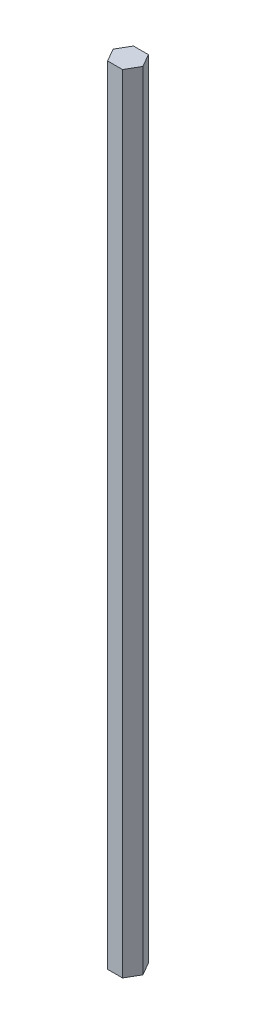
ISO-10303-21;
HEADER;
FILE_DESCRIPTION(('STEP AP214'),'2;1');
FILE_NAME('part.step','',(''),(''),'','','');
FILE_SCHEMA(('AUTOMOTIVE_DESIGN { 1 0 10303 214 1 1 1 1 }'));
ENDSEC;
DATA;
#1=APPLICATION_CONTEXT('core data for automotive mechanical design processes');
#2=APPLICATION_PROTOCOL_DEFINITION('international standard','automotive_design',2000,#1);
#3=PRODUCT_CONTEXT('',#1,'mechanical');
#4=PRODUCT('Part','Part','',(#3));
#5=PRODUCT_RELATED_PRODUCT_CATEGORY('part','',(#4));
#6=PRODUCT_DEFINITION_FORMATION('','',#4);
#7=PRODUCT_DEFINITION_CONTEXT('part definition',#1,'design');
#8=PRODUCT_DEFINITION('design','',#6,#7);
#9=PRODUCT_DEFINITION_SHAPE('','',#8);
#10=(LENGTH_UNIT() NAMED_UNIT(*) SI_UNIT(.MILLI.,.METRE.));
#11=(NAMED_UNIT(*) PLANE_ANGLE_UNIT() SI_UNIT($,.RADIAN.));
#12=(NAMED_UNIT(*) SI_UNIT($,.STERADIAN.) SOLID_ANGLE_UNIT());
#13=UNCERTAINTY_MEASURE_WITH_UNIT(LENGTH_MEASURE(1.E-05),#10,'distance_accuracy_value','');
#14=(GEOMETRIC_REPRESENTATION_CONTEXT(3) GLOBAL_UNCERTAINTY_ASSIGNED_CONTEXT((#13)) GLOBAL_UNIT_ASSIGNED_CONTEXT((#10,
#11,#12)) REPRESENTATION_CONTEXT('',''));
#15=CARTESIAN_POINT('',(0.,0.,0.));
#16=DIRECTION('',(0.,0.,1.));
#17=DIRECTION('',(1.,0.,0.));
#18=AXIS2_PLACEMENT_3D('',#15,#16,#17);
#19=CARTESIAN_POINT('',(-6.62598236841815,355.6,2.38647576718608));
#20=DIRECTION('',(0.,0.,-1.));
#21=DIRECTION('',(-1.,0.,0.));
#22=AXIS2_PLACEMENT_3D('',#19,#20,#21);
#23=PLANE('',#22);
#24=DIRECTION('',(1.,0.,0.));
#25=VECTOR('',#24,1.);
#26=CARTESIAN_POINT('',(-6.62598236841815,0.,2.38647576718608));
#27=LINE('',#26,#25);
#28=CARTESIAN_POINT('',(-6.62598236841815,0.,2.38647576718608));
#29=VERTEX_POINT('',#28);
#30=CARTESIAN_POINT('',(0.120257631581846,0.,2.38647576718608));
#31=VERTEX_POINT('',#30);
#32=EDGE_CURVE('E128',#29,#31,#27,.T.);
#33=ORIENTED_EDGE('',*,*,#32,.T.);
#34=DIRECTION('',(0.,-1.,0.));
#35=VECTOR('',#34,1.);
#36=CARTESIAN_POINT('',(0.120257631581846,355.6,2.38647576718608));
#37=LINE('',#36,#35);
#38=CARTESIAN_POINT('',(0.120257631581846,355.6,2.38647576718608));
#39=VERTEX_POINT('',#38);
#40=EDGE_CURVE('E11',#39,#31,#37,.T.);
#41=ORIENTED_EDGE('',*,*,#40,.F.);
#42=DIRECTION('',(1.,0.,0.));
#43=VECTOR('',#42,1.);
#44=CARTESIAN_POINT('',(-6.62598236841815,355.6,2.38647576718608));
#45=LINE('',#44,#43);
#46=CARTESIAN_POINT('',(-6.62598236841815,355.6,2.38647576718608));
#47=VERTEX_POINT('',#46);
#48=EDGE_CURVE('E144',#47,#39,#45,.T.);
#49=ORIENTED_EDGE('',*,*,#48,.F.);
#50=DIRECTION('',(0.,-1.,0.));
#51=VECTOR('',#50,1.);
#52=CARTESIAN_POINT('',(-6.62598236841815,355.6,2.38647576718608));
#53=LINE('',#52,#51);
#54=EDGE_CURVE('E124',#47,#29,#53,.T.);
#55=ORIENTED_EDGE('',*,*,#54,.T.);
#56=EDGE_LOOP('',(#33,#41,#49,#55));
#57=FACE_BOUND('',#56,.T.);
#58=ADVANCED_FACE('F39',(#57),#23,.F.);
#59=CARTESIAN_POINT('',(0.120257631581846,355.6,2.38647576718608));
#60=DIRECTION('',(-0.866025403784439,0.,-0.5));
#61=DIRECTION('',(-0.5,0.,0.866025403784439));
#62=AXIS2_PLACEMENT_3D('',#59,#60,#61);
#63=PLANE('',#62);
#64=DIRECTION('',(0.5,0.,-0.866025403784439));
#65=VECTOR('',#64,1.);
#66=CARTESIAN_POINT('',(0.120257631581846,0.,2.38647576718608));
#67=LINE('',#66,#65);
#68=CARTESIAN_POINT('',(3.49337763158184,0.,-3.45593945284065));
#69=VERTEX_POINT('',#68);
#70=EDGE_CURVE('E132',#31,#69,#67,.T.);
#71=ORIENTED_EDGE('',*,*,#70,.T.);
#72=DIRECTION('',(0.,-1.,0.));
#73=VECTOR('',#72,1.);
#74=CARTESIAN_POINT('',(3.49337763158184,355.6,-3.45593945284065));
#75=LINE('',#74,#73);
#76=CARTESIAN_POINT('',(3.49337763158184,355.6,-3.45593945284065));
#77=VERTEX_POINT('',#76);
#78=EDGE_CURVE('E48',#77,#69,#75,.T.);
#79=ORIENTED_EDGE('',*,*,#78,.F.);
#80=DIRECTION('',(0.5,0.,-0.866025403784439));
#81=VECTOR('',#80,1.);
#82=CARTESIAN_POINT('',(0.120257631581846,355.6,2.38647576718608));
#83=LINE('',#82,#81);
#84=EDGE_CURVE('E93',#39,#77,#83,.T.);
#85=ORIENTED_EDGE('',*,*,#84,.F.);
#86=ORIENTED_EDGE('',*,*,#40,.T.);
#87=EDGE_LOOP('',(#71,#79,#85,#86));
#88=FACE_BOUND('',#87,.T.);
#89=ADVANCED_FACE('F172',(#88),#63,.F.);
#90=CARTESIAN_POINT('',(3.49337763158184,355.6,-3.45593945284065));
#91=DIRECTION('',(-0.866025403784438,0.,0.5));
#92=DIRECTION('',(0.5,0.,0.866025403784439));
#93=AXIS2_PLACEMENT_3D('',#90,#91,#92);
#94=PLANE('',#93);
#95=DIRECTION('',(-0.5,0.,-0.866025403784438));
#96=VECTOR('',#95,1.);
#97=CARTESIAN_POINT('',(3.49337763158184,0.,-3.45593945284065));
#98=LINE('',#97,#96);
#99=CARTESIAN_POINT('',(0.120257631581841,0.,-9.29835467286738));
#100=VERTEX_POINT('',#99);
#101=EDGE_CURVE('E135',#69,#100,#98,.T.);
#102=ORIENTED_EDGE('',*,*,#101,.T.);
#103=DIRECTION('',(0.,-1.,0.));
#104=VECTOR('',#103,1.);
#105=CARTESIAN_POINT('',(0.120257631581841,355.6,-9.29835467286738));
#106=LINE('',#105,#104);
#107=CARTESIAN_POINT('',(0.120257631581841,355.6,-9.29835467286738));
#108=VERTEX_POINT('',#107);
#109=EDGE_CURVE('E117',#108,#100,#106,.T.);
#110=ORIENTED_EDGE('',*,*,#109,.F.);
#111=DIRECTION('',(-0.5,0.,-0.866025403784438));
#112=VECTOR('',#111,1.);
#113=CARTESIAN_POINT('',(3.49337763158184,355.6,-3.45593945284065));
#114=LINE('',#113,#112);
#115=EDGE_CURVE('E106',#77,#108,#114,.T.);
#116=ORIENTED_EDGE('',*,*,#115,.F.);
#117=ORIENTED_EDGE('',*,*,#78,.T.);
#118=EDGE_LOOP('',(#102,#110,#116,#117));
#119=FACE_BOUND('',#118,.T.);
#120=ADVANCED_FACE('F154',(#119),#94,.F.);
#121=CARTESIAN_POINT('',(0.120257631581841,355.6,-9.29835467286738));
#122=DIRECTION('',(0.,0.,1.));
#123=DIRECTION('',(1.,0.,0.));
#124=AXIS2_PLACEMENT_3D('',#121,#122,#123);
#125=PLANE('',#124);
#126=DIRECTION('',(-1.,0.,0.));
#127=VECTOR('',#126,1.);
#128=CARTESIAN_POINT('',(0.120257631581841,0.,-9.29835467286738));
#129=LINE('',#128,#127);
#130=CARTESIAN_POINT('',(-6.62598236841816,0.,-9.29835467286738));
#131=VERTEX_POINT('',#130);
#132=EDGE_CURVE('E115',#100,#131,#129,.T.);
#133=ORIENTED_EDGE('',*,*,#132,.T.);
#134=DIRECTION('',(0.,-1.,0.));
#135=VECTOR('',#134,1.);
#136=CARTESIAN_POINT('',(-6.62598236841816,355.6,-9.29835467286738));
#137=LINE('',#136,#135);
#138=CARTESIAN_POINT('',(-6.62598236841816,355.6,-9.29835467286738));
#139=VERTEX_POINT('',#138);
#140=EDGE_CURVE('E112',#139,#131,#137,.T.);
#141=ORIENTED_EDGE('',*,*,#140,.F.);
#142=DIRECTION('',(-1.,0.,0.));
#143=VECTOR('',#142,1.);
#144=CARTESIAN_POINT('',(0.120257631581841,355.6,-9.29835467286738));
#145=LINE('',#144,#143);
#146=EDGE_CURVE('E100',#108,#139,#145,.T.);
#147=ORIENTED_EDGE('',*,*,#146,.F.);
#148=ORIENTED_EDGE('',*,*,#109,.T.);
#149=EDGE_LOOP('',(#133,#141,#147,#148));
#150=FACE_BOUND('',#149,.T.);
#151=ADVANCED_FACE('F113',(#150),#125,.F.);
#152=CARTESIAN_POINT('',(-6.62598236841816,355.6,-9.29835467286738));
#153=DIRECTION('',(0.866025403784439,0.,0.499999999999999));
#154=DIRECTION('',(0.499999999999999,0.,-0.866025403784439));
#155=AXIS2_PLACEMENT_3D('',#152,#153,#154);
#156=PLANE('',#155);
#157=DIRECTION('',(-0.499999999999999,0.,0.866025403784439));
#158=VECTOR('',#157,1.);
#159=CARTESIAN_POINT('',(-6.62598236841816,0.,-9.29835467286738));
#160=LINE('',#159,#158);
#161=CARTESIAN_POINT('',(-9.99910236841815,0.,-3.45593945284065));
#162=VERTEX_POINT('',#161);
#163=EDGE_CURVE('E79',#131,#162,#160,.T.);
#164=ORIENTED_EDGE('',*,*,#163,.T.);
#165=DIRECTION('',(0.,-1.,0.));
#166=VECTOR('',#165,1.);
#167=CARTESIAN_POINT('',(-9.99910236841815,355.6,-3.45593945284065));
#168=LINE('',#167,#166);
#169=CARTESIAN_POINT('',(-9.99910236841815,355.6,-3.45593945284065));
#170=VERTEX_POINT('',#169);
#171=EDGE_CURVE('E118',#170,#162,#168,.T.);
#172=ORIENTED_EDGE('',*,*,#171,.F.);
#173=DIRECTION('',(-0.499999999999999,0.,0.866025403784439));
#174=VECTOR('',#173,1.);
#175=CARTESIAN_POINT('',(-6.62598236841816,355.6,-9.29835467286738));
#176=LINE('',#175,#174);
#177=EDGE_CURVE('E104',#139,#170,#176,.T.);
#178=ORIENTED_EDGE('',*,*,#177,.F.);
#179=ORIENTED_EDGE('',*,*,#140,.T.);
#180=EDGE_LOOP('',(#164,#172,#178,#179));
#181=FACE_BOUND('',#180,.T.);
#182=ADVANCED_FACE('F120',(#181),#156,.F.);
#183=CARTESIAN_POINT('',(-9.99910236841815,355.6,-3.45593945284065));
#184=DIRECTION('',(0.866025403784438,0.,-0.5));
#185=DIRECTION('',(-0.5,0.,-0.866025403784439));
#186=AXIS2_PLACEMENT_3D('',#183,#184,#185);
#187=PLANE('',#186);
#188=DIRECTION('',(0.5,0.,0.866025403784438));
#189=VECTOR('',#188,1.);
#190=CARTESIAN_POINT('',(-9.99910236841815,0.,-3.45593945284065));
#191=LINE('',#190,#189);
#192=EDGE_CURVE('E85',#162,#29,#191,.T.);
#193=ORIENTED_EDGE('',*,*,#192,.T.);
#194=ORIENTED_EDGE('',*,*,#54,.F.);
#195=DIRECTION('',(0.5,0.,0.866025403784438));
#196=VECTOR('',#195,1.);
#197=CARTESIAN_POINT('',(-9.99910236841815,355.6,-3.45593945284065));
#198=LINE('',#197,#196);
#199=EDGE_CURVE('E56',#170,#47,#198,.T.);
#200=ORIENTED_EDGE('',*,*,#199,.F.);
#201=ORIENTED_EDGE('',*,*,#171,.T.);
#202=EDGE_LOOP('',(#193,#194,#200,#201));
#203=FACE_BOUND('',#202,.T.);
#204=ADVANCED_FACE('F161',(#203),#187,.F.);
#205=CARTESIAN_POINT('',(0.,355.6,0.));
#206=DIRECTION('',(0.,1.,0.));
#207=DIRECTION('',(0.,0.,1.));
#208=AXIS2_PLACEMENT_3D('',#205,#206,#207);
#209=PLANE('',#208);
#210=ORIENTED_EDGE('',*,*,#48,.T.);
#211=ORIENTED_EDGE('',*,*,#84,.T.);
#212=ORIENTED_EDGE('',*,*,#115,.T.);
#213=ORIENTED_EDGE('',*,*,#146,.T.);
#214=ORIENTED_EDGE('',*,*,#177,.T.);
#215=ORIENTED_EDGE('',*,*,#199,.T.);
#216=EDGE_LOOP('',(#210,#211,#212,#213,#214,#215));
#217=FACE_BOUND('',#216,.T.);
#218=ADVANCED_FACE('F102',(#217),#209,.T.);
#219=CARTESIAN_POINT('',(0.,0.,0.));
#220=DIRECTION('',(0.,1.,0.));
#221=DIRECTION('',(0.,0.,1.));
#222=AXIS2_PLACEMENT_3D('',#219,#220,#221);
#223=PLANE('',#222);
#224=ORIENTED_EDGE('',*,*,#32,.F.);
#225=ORIENTED_EDGE('',*,*,#192,.F.);
#226=ORIENTED_EDGE('',*,*,#163,.F.);
#227=ORIENTED_EDGE('',*,*,#132,.F.);
#228=ORIENTED_EDGE('',*,*,#101,.F.);
#229=ORIENTED_EDGE('',*,*,#70,.F.);
#230=EDGE_LOOP('',(#224,#225,#226,#227,#228,#229));
#231=FACE_BOUND('',#230,.T.);
#232=ADVANCED_FACE('F157',(#231),#223,.F.);
#233=CLOSED_SHELL('',(#58,#89,#120,#151,#182,#204,#218,#232));
#234=MANIFOLD_SOLID_BREP('B2',#233);
#235=ADVANCED_BREP_SHAPE_REPRESENTATION('',(#18,#234),#14);
#236=SHAPE_DEFINITION_REPRESENTATION(#9,#235);
ENDSEC;
END-ISO-10303-21;
